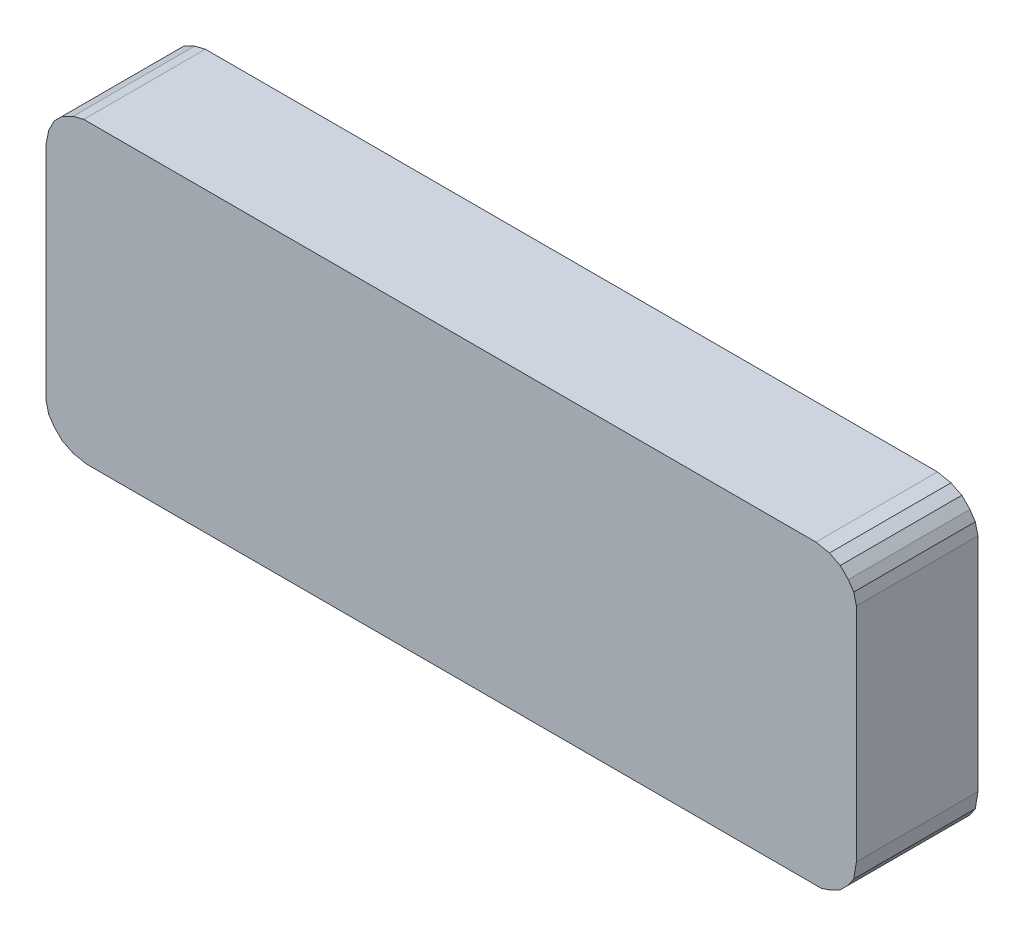
ISO-10303-21;
HEADER;
FILE_DESCRIPTION(('STEP AP214'),'2;1');
FILE_NAME('part.step','',(''),(''),'','','');
FILE_SCHEMA(('AUTOMOTIVE_DESIGN { 1 0 10303 214 1 1 1 1 }'));
ENDSEC;
DATA;
#1=APPLICATION_CONTEXT('core data for automotive mechanical design processes');
#2=APPLICATION_PROTOCOL_DEFINITION('international standard','automotive_design',2000,#1);
#3=PRODUCT_CONTEXT('',#1,'mechanical');
#4=PRODUCT('Part','Part','',(#3));
#5=PRODUCT_RELATED_PRODUCT_CATEGORY('part','',(#4));
#6=PRODUCT_DEFINITION_FORMATION('','',#4);
#7=PRODUCT_DEFINITION_CONTEXT('part definition',#1,'design');
#8=PRODUCT_DEFINITION('design','',#6,#7);
#9=PRODUCT_DEFINITION_SHAPE('','',#8);
#10=(LENGTH_UNIT() NAMED_UNIT(*) SI_UNIT(.MILLI.,.METRE.));
#11=(NAMED_UNIT(*) PLANE_ANGLE_UNIT() SI_UNIT($,.RADIAN.));
#12=(NAMED_UNIT(*) SI_UNIT($,.STERADIAN.) SOLID_ANGLE_UNIT());
#13=UNCERTAINTY_MEASURE_WITH_UNIT(LENGTH_MEASURE(1.E-05),#10,'distance_accuracy_value','');
#14=(GEOMETRIC_REPRESENTATION_CONTEXT(3) GLOBAL_UNCERTAINTY_ASSIGNED_CONTEXT((#13)) GLOBAL_UNIT_ASSIGNED_CONTEXT((#10,
#11,#12)) REPRESENTATION_CONTEXT('',''));
#15=CARTESIAN_POINT('',(0.,0.,0.));
#16=DIRECTION('',(0.,0.,1.));
#17=DIRECTION('',(1.,0.,0.));
#18=AXIS2_PLACEMENT_3D('',#15,#16,#17);
#19=CARTESIAN_POINT('',(-1.49999954,0.40000174,0.45));
#20=DIRECTION('',(0.,0.,1.));
#21=DIRECTION('',(1.,0.,0.));
#22=AXIS2_PLACEMENT_3D('',#19,#20,#21);
#23=PLANE('',#22);
#24=DIRECTION('',(-0.447213595499958,-0.894427190999916,0.));
#25=VECTOR('',#24,1.);
#26=CARTESIAN_POINT('',(-1.4699996,0.49000156,0.45));
#27=LINE('',#26,#25);
#28=CARTESIAN_POINT('',(-1.4699996,0.49000156,0.45));
#29=VERTEX_POINT('',#28);
#30=CARTESIAN_POINT('',(-1.48999956,0.450001640000001,0.45));
#31=VERTEX_POINT('',#30);
#32=EDGE_CURVE('E205',#29,#31,#27,.T.);
#33=ORIENTED_EDGE('',*,*,#32,.T.);
#34=DIRECTION('',(-0.196116135138182,-0.980580675690921,0.));
#35=VECTOR('',#34,1.);
#36=CARTESIAN_POINT('',(-1.48999956,0.45000164,0.45));
#37=LINE('',#36,#35);
#38=CARTESIAN_POINT('',(-1.49999954,0.40000174,0.45));
#39=VERTEX_POINT('',#38);
#40=EDGE_CURVE('E210',#31,#39,#37,.T.);
#41=ORIENTED_EDGE('',*,*,#40,.T.);
#42=DIRECTION('',(0.,1.,0.));
#43=VECTOR('',#42,1.);
#44=CARTESIAN_POINT('',(-1.49999954,-0.41999916,0.45));
#45=LINE('',#44,#43);
#46=CARTESIAN_POINT('',(-1.49999954,-0.419999159999998,0.45));
#47=VERTEX_POINT('',#46);
#48=EDGE_CURVE('E213',#47,#39,#45,.T.);
#49=ORIENTED_EDGE('',*,*,#48,.F.);
#50=DIRECTION('',(0.242535625036098,-0.970142500145391,0.));
#51=VECTOR('',#50,1.);
#52=CARTESIAN_POINT('',(-1.48999956,-0.45999908,0.45));
#53=LINE('',#52,#51);
#54=CARTESIAN_POINT('',(-1.48999956,-0.459999079999999,0.45));
#55=VERTEX_POINT('',#54);
#56=EDGE_CURVE('E217',#55,#47,#53,.F.);
#57=ORIENTED_EDGE('',*,*,#56,.F.);
#58=DIRECTION('',(0.554700196224998,-0.832050294337998,0.));
#59=VECTOR('',#58,1.);
#60=CARTESIAN_POINT('',(-1.4699996,-0.48999902,0.45));
#61=LINE('',#60,#59);
#62=CARTESIAN_POINT('',(-1.4699996,-0.48999902,0.45));
#63=VERTEX_POINT('',#62);
#64=EDGE_CURVE('E222',#63,#55,#61,.F.);
#65=ORIENTED_EDGE('',*,*,#64,.F.);
#66=DIRECTION('',(0.707106781186548,-0.707106781186548,0.));
#67=VECTOR('',#66,1.);
#68=CARTESIAN_POINT('',(-1.43999966,-0.51999896,0.45));
#69=LINE('',#68,#67);
#70=CARTESIAN_POINT('',(-1.43999966,-0.51999896,0.45));
#71=VERTEX_POINT('',#70);
#72=EDGE_CURVE('E228',#71,#63,#69,.F.);
#73=ORIENTED_EDGE('',*,*,#72,.F.);
#74=DIRECTION('',(0.894427190999916,-0.447213595499958,0.));
#75=VECTOR('',#74,1.);
#76=CARTESIAN_POINT('',(-1.39999974,-0.53999892,0.45));
#77=LINE('',#76,#75);
#78=CARTESIAN_POINT('',(-1.39999974,-0.539998920000003,0.45));
#79=VERTEX_POINT('',#78);
#80=EDGE_CURVE('E234',#79,#71,#77,.F.);
#81=ORIENTED_EDGE('',*,*,#80,.F.);
#82=DIRECTION('',(0.980580675690959,-0.196116135137992,0.));
#83=VECTOR('',#82,1.);
#84=CARTESIAN_POINT('',(-1.34999984,-0.5499989,0.45));
#85=LINE('',#84,#83);
#86=CARTESIAN_POINT('',(-1.34999984,-0.5499989,0.45));
#87=VERTEX_POINT('',#86);
#88=EDGE_CURVE('E239',#87,#79,#85,.F.);
#89=ORIENTED_EDGE('',*,*,#88,.F.);
#90=DIRECTION('',(1.,0.,0.));
#91=VECTOR('',#90,1.);
#92=CARTESIAN_POINT('',(1.3699998,-0.5499989,0.45));
#93=LINE('',#92,#91);
#94=CARTESIAN_POINT('',(1.3699998,-0.5499989,0.45));
#95=VERTEX_POINT('',#94);
#96=EDGE_CURVE('E245',#95,#87,#93,.F.);
#97=ORIENTED_EDGE('',*,*,#96,.F.);
#98=DIRECTION('',(0.948683298050414,0.316227766017138,0.));
#99=VECTOR('',#98,1.);
#100=CARTESIAN_POINT('',(1.39999974,-0.53999892,0.45));
#101=LINE('',#100,#99);
#102=CARTESIAN_POINT('',(1.39999974,-0.53999892,0.45));
#103=VERTEX_POINT('',#102);
#104=EDGE_CURVE('E251',#103,#95,#101,.F.);
#105=ORIENTED_EDGE('',*,*,#104,.F.);
#106=DIRECTION('',(0.894427190999916,0.447213595499958,0.));
#107=VECTOR('',#106,1.);
#108=CARTESIAN_POINT('',(1.43999966,-0.51999896,0.45));
#109=LINE('',#108,#107);
#110=CARTESIAN_POINT('',(1.43999965999999,-0.519998959999995,0.45));
#111=VERTEX_POINT('',#110);
#112=EDGE_CURVE('E257',#111,#103,#109,.F.);
#113=ORIENTED_EDGE('',*,*,#112,.F.);
#114=DIRECTION('',(0.707106781187048,0.707106781186048,0.));
#115=VECTOR('',#114,1.);
#116=CARTESIAN_POINT('',(1.4699996,-0.48999902,0.45));
#117=LINE('',#116,#115);
#118=CARTESIAN_POINT('',(1.4699996,-0.489999020000001,0.45));
#119=VERTEX_POINT('',#118);
#120=EDGE_CURVE('E263',#119,#111,#117,.F.);
#121=ORIENTED_EDGE('',*,*,#120,.F.);
#122=DIRECTION('',(0.554700196224998,0.832050294337998,0.));
#123=VECTOR('',#122,1.);
#124=CARTESIAN_POINT('',(1.48999956,-0.45999908,0.45));
#125=LINE('',#124,#123);
#126=CARTESIAN_POINT('',(1.48999956,-0.459999080000001,0.45));
#127=VERTEX_POINT('',#126);
#128=EDGE_CURVE('E269',#127,#119,#125,.F.);
#129=ORIENTED_EDGE('',*,*,#128,.F.);
#130=DIRECTION('',(0.164398987305033,0.986393923832198,0.));
#131=VECTOR('',#130,1.);
#132=CARTESIAN_POINT('',(1.49999954,-0.3999992,0.45));
#133=LINE('',#132,#131);
#134=CARTESIAN_POINT('',(1.49999954,-0.3999992,0.45));
#135=VERTEX_POINT('',#134);
#136=EDGE_CURVE('E275',#135,#127,#133,.F.);
#137=ORIENTED_EDGE('',*,*,#136,.F.);
#138=DIRECTION('',(0.,1.,0.));
#139=VECTOR('',#138,1.);
#140=CARTESIAN_POINT('',(1.49999954,0.4200017,0.45));
#141=LINE('',#140,#139);
#142=CARTESIAN_POINT('',(1.49999954,0.4200017,0.45));
#143=VERTEX_POINT('',#142);
#144=EDGE_CURVE('E281',#143,#135,#141,.F.);
#145=ORIENTED_EDGE('',*,*,#144,.F.);
#146=DIRECTION('',(-0.242535625036098,0.970142500145391,0.));
#147=VECTOR('',#146,1.);
#148=CARTESIAN_POINT('',(1.48999956,0.46000162,0.45));
#149=LINE('',#148,#147);
#150=CARTESIAN_POINT('',(1.48999956,0.460001619999999,0.45));
#151=VERTEX_POINT('',#150);
#152=EDGE_CURVE('E287',#151,#143,#149,.F.);
#153=ORIENTED_EDGE('',*,*,#152,.F.);
#154=DIRECTION('',(-0.554700196224998,0.832050294337998,0.));
#155=VECTOR('',#154,1.);
#156=CARTESIAN_POINT('',(1.4699996,0.49000156,0.45));
#157=LINE('',#156,#155);
#158=CARTESIAN_POINT('',(1.4699996,0.49000156,0.45));
#159=VERTEX_POINT('',#158);
#160=EDGE_CURVE('E293',#159,#151,#157,.F.);
#161=ORIENTED_EDGE('',*,*,#160,.F.);
#162=DIRECTION('',(-0.707106781186548,0.707106781186548,0.));
#163=VECTOR('',#162,1.);
#164=CARTESIAN_POINT('',(1.43999966,0.5200015,0.45));
#165=LINE('',#164,#163);
#166=CARTESIAN_POINT('',(1.43999966,0.5200015,0.45));
#167=VERTEX_POINT('',#166);
#168=EDGE_CURVE('E299',#167,#159,#165,.F.);
#169=ORIENTED_EDGE('',*,*,#168,.F.);
#170=DIRECTION('',(-0.894427190999916,0.447213595499958,0.));
#171=VECTOR('',#170,1.);
#172=CARTESIAN_POINT('',(1.39999974,0.54000146,0.45));
#173=LINE('',#172,#171);
#174=CARTESIAN_POINT('',(1.39999974,0.540001460000003,0.45));
#175=VERTEX_POINT('',#174);
#176=EDGE_CURVE('E305',#175,#167,#173,.F.);
#177=ORIENTED_EDGE('',*,*,#176,.F.);
#178=DIRECTION('',(-0.980580675690959,0.196116135137992,0.));
#179=VECTOR('',#178,1.);
#180=CARTESIAN_POINT('',(1.34999984,0.55000144,0.45));
#181=LINE('',#180,#179);
#182=CARTESIAN_POINT('',(1.34999984,0.55000144,0.45));
#183=VERTEX_POINT('',#182);
#184=EDGE_CURVE('E311',#183,#175,#181,.F.);
#185=ORIENTED_EDGE('',*,*,#184,.F.);
#186=DIRECTION('',(1.,0.,0.));
#187=VECTOR('',#186,1.);
#188=CARTESIAN_POINT('',(-1.35999982,0.55000144,0.45));
#189=LINE('',#188,#187);
#190=CARTESIAN_POINT('',(-1.35999982,0.550001439999997,0.45));
#191=VERTEX_POINT('',#190);
#192=EDGE_CURVE('E180',#191,#183,#189,.T.);
#193=ORIENTED_EDGE('',*,*,#192,.F.);
#194=DIRECTION('',(-0.970142500145332,-0.242535625036332,0.));
#195=VECTOR('',#194,1.);
#196=CARTESIAN_POINT('',(-1.35999982,0.55000144,0.45));
#197=LINE('',#196,#195);
#198=CARTESIAN_POINT('',(-1.39999974,0.54000146,0.45));
#199=VERTEX_POINT('',#198);
#200=EDGE_CURVE('E19',#191,#199,#197,.T.);
#201=ORIENTED_EDGE('',*,*,#200,.T.);
#202=DIRECTION('',(-0.894427190999917,-0.447213595499956,0.));
#203=VECTOR('',#202,1.);
#204=CARTESIAN_POINT('',(-1.39999974,0.54000146,0.45));
#205=LINE('',#204,#203);
#206=CARTESIAN_POINT('',(-1.43999966000001,0.5200015,0.45));
#207=VERTEX_POINT('',#206);
#208=EDGE_CURVE('E175',#199,#207,#205,.T.);
#209=ORIENTED_EDGE('',*,*,#208,.T.);
#210=DIRECTION('',(-0.707106781186546,-0.707106781186549,0.));
#211=VECTOR('',#210,1.);
#212=CARTESIAN_POINT('',(-1.43999966,0.5200015,0.45));
#213=LINE('',#212,#211);
#214=EDGE_CURVE('E199',#207,#29,#213,.T.);
#215=ORIENTED_EDGE('',*,*,#214,.T.);
#216=EDGE_LOOP('',(#33,#41,#49,#57,#65,#73,#81,#89,#97,#105,#113,#121,#129,#137,#145,#153,#161,
#169,#177,#185,#193,#201,#209,#215));
#217=FACE_BOUND('',#216,.T.);
#218=ADVANCED_FACE('F16',(#217),#23,.T.);
#219=CARTESIAN_POINT('',(-1.49999954,-0.41999916,0.));
#220=DIRECTION('',(-1.,0.,0.));
#221=DIRECTION('',(0.,0.,1.));
#222=AXIS2_PLACEMENT_3D('',#219,#220,#221);
#223=PLANE('',#222);
#224=DIRECTION('',(0.,0.,1.));
#225=VECTOR('',#224,1.);
#226=CARTESIAN_POINT('',(-1.49999954,0.40000174,0.));
#227=LINE('',#226,#225);
#228=CARTESIAN_POINT('',(-1.49999954,0.40000174,0.));
#229=VERTEX_POINT('',#228);
#230=EDGE_CURVE('E329',#229,#39,#227,.T.);
#231=ORIENTED_EDGE('',*,*,#230,.F.);
#232=DIRECTION('',(0.,1.,0.));
#233=VECTOR('',#232,1.);
#234=CARTESIAN_POINT('',(-1.49999954,0.40000174,0.));
#235=LINE('',#234,#233);
#236=CARTESIAN_POINT('',(-1.49999954,-0.419999159999999,0.));
#237=VERTEX_POINT('',#236);
#238=EDGE_CURVE('E335',#229,#237,#235,.F.);
#239=ORIENTED_EDGE('',*,*,#238,.T.);
#240=DIRECTION('',(0.,0.,1.));
#241=VECTOR('',#240,1.);
#242=CARTESIAN_POINT('',(-1.49999953999999,-0.419999159999998,0.));
#243=LINE('',#242,#241);
#244=EDGE_CURVE('E219',#47,#237,#243,.F.);
#245=ORIENTED_EDGE('',*,*,#244,.F.);
#246=ORIENTED_EDGE('',*,*,#48,.T.);
#247=EDGE_LOOP('',(#231,#239,#245,#246));
#248=FACE_BOUND('',#247,.T.);
#249=ADVANCED_FACE('F438',(#248),#223,.T.);
#250=CARTESIAN_POINT('',(-1.48999956,-0.45999908,0.));
#251=DIRECTION('',(-0.970142500145391,-0.242535625036098,0.));
#252=DIRECTION('',(0.242535625036098,-0.970142500145391,0.));
#253=AXIS2_PLACEMENT_3D('',#250,#251,#252);
#254=PLANE('',#253);
#255=ORIENTED_EDGE('',*,*,#244,.T.);
#256=DIRECTION('',(0.24253562503633,-0.970142500145333,0.));
#257=VECTOR('',#256,1.);
#258=CARTESIAN_POINT('',(-1.49999954,-0.41999916,0.));
#259=LINE('',#258,#257);
#260=CARTESIAN_POINT('',(-1.48999956,-0.459999079999999,0.));
#261=VERTEX_POINT('',#260);
#262=EDGE_CURVE('E339',#237,#261,#259,.T.);
#263=ORIENTED_EDGE('',*,*,#262,.T.);
#264=DIRECTION('',(0.,0.,1.));
#265=VECTOR('',#264,1.);
#266=CARTESIAN_POINT('',(-1.48999955999999,-0.459999079999994,0.));
#267=LINE('',#266,#265);
#268=EDGE_CURVE('E225',#55,#261,#267,.F.);
#269=ORIENTED_EDGE('',*,*,#268,.F.);
#270=ORIENTED_EDGE('',*,*,#56,.T.);
#271=EDGE_LOOP('',(#255,#263,#269,#270));
#272=FACE_BOUND('',#271,.T.);
#273=ADVANCED_FACE('F524',(#272),#254,.T.);
#274=CARTESIAN_POINT('',(-1.4699996,-0.48999902,0.));
#275=DIRECTION('',(-0.832050294337998,-0.554700196224998,0.));
#276=DIRECTION('',(0.554700196224998,-0.832050294337998,0.));
#277=AXIS2_PLACEMENT_3D('',#274,#275,#276);
#278=PLANE('',#277);
#279=ORIENTED_EDGE('',*,*,#268,.T.);
#280=DIRECTION('',(0.55470019622523,-0.832050294337843,0.));
#281=VECTOR('',#280,1.);
#282=CARTESIAN_POINT('',(-1.48999956,-0.45999908,0.));
#283=LINE('',#282,#281);
#284=CARTESIAN_POINT('',(-1.4699996,-0.48999902,0.));
#285=VERTEX_POINT('',#284);
#286=EDGE_CURVE('E343',#261,#285,#283,.T.);
#287=ORIENTED_EDGE('',*,*,#286,.T.);
#288=DIRECTION('',(0.,0.,1.));
#289=VECTOR('',#288,1.);
#290=CARTESIAN_POINT('',(-1.4699996,-0.48999902,0.));
#291=LINE('',#290,#289);
#292=EDGE_CURVE('E231',#63,#285,#291,.F.);
#293=ORIENTED_EDGE('',*,*,#292,.F.);
#294=ORIENTED_EDGE('',*,*,#64,.T.);
#295=EDGE_LOOP('',(#279,#287,#293,#294));
#296=FACE_BOUND('',#295,.T.);
#297=ADVANCED_FACE('F520',(#296),#278,.T.);
#298=CARTESIAN_POINT('',(-1.43999966,-0.51999896,0.));
#299=DIRECTION('',(-0.707106781186548,-0.707106781186548,0.));
#300=DIRECTION('',(0.707106781186548,-0.707106781186548,0.));
#301=AXIS2_PLACEMENT_3D('',#298,#299,#300);
#302=PLANE('',#301);
#303=ORIENTED_EDGE('',*,*,#292,.T.);
#304=DIRECTION('',(0.707106781186545,-0.70710678118655,0.));
#305=VECTOR('',#304,1.);
#306=CARTESIAN_POINT('',(-1.4699996,-0.48999902,0.));
#307=LINE('',#306,#305);
#308=CARTESIAN_POINT('',(-1.43999966,-0.51999896,0.));
#309=VERTEX_POINT('',#308);
#310=EDGE_CURVE('E347',#285,#309,#307,.T.);
#311=ORIENTED_EDGE('',*,*,#310,.T.);
#312=DIRECTION('',(0.,0.,1.));
#313=VECTOR('',#312,1.);
#314=CARTESIAN_POINT('',(-1.43999966,-0.51999896,0.));
#315=LINE('',#314,#313);
#316=EDGE_CURVE('E237',#71,#309,#315,.F.);
#317=ORIENTED_EDGE('',*,*,#316,.F.);
#318=ORIENTED_EDGE('',*,*,#72,.T.);
#319=EDGE_LOOP('',(#303,#311,#317,#318));
#320=FACE_BOUND('',#319,.T.);
#321=ADVANCED_FACE('F516',(#320),#302,.T.);
#322=CARTESIAN_POINT('',(-1.39999974,-0.53999892,0.));
#323=DIRECTION('',(-0.447213595499958,-0.894427190999916,0.));
#324=DIRECTION('',(0.894427190999916,-0.447213595499958,0.));
#325=AXIS2_PLACEMENT_3D('',#322,#323,#324);
#326=PLANE('',#325);
#327=ORIENTED_EDGE('',*,*,#316,.T.);
#328=DIRECTION('',(0.894427190999917,-0.447213595499956,0.));
#329=VECTOR('',#328,1.);
#330=CARTESIAN_POINT('',(-1.43999966,-0.51999896,0.));
#331=LINE('',#330,#329);
#332=CARTESIAN_POINT('',(-1.39999974,-0.539998920000003,0.));
#333=VERTEX_POINT('',#332);
#334=EDGE_CURVE('E351',#309,#333,#331,.T.);
#335=ORIENTED_EDGE('',*,*,#334,.T.);
#336=DIRECTION('',(0.,0.,1.));
#337=VECTOR('',#336,1.);
#338=CARTESIAN_POINT('',(-1.39999974,-0.53999892000001,0.));
#339=LINE('',#338,#337);
#340=EDGE_CURVE('E242',#79,#333,#339,.F.);
#341=ORIENTED_EDGE('',*,*,#340,.F.);
#342=ORIENTED_EDGE('',*,*,#80,.T.);
#343=EDGE_LOOP('',(#327,#335,#341,#342));
#344=FACE_BOUND('',#343,.T.);
#345=ADVANCED_FACE('F512',(#344),#326,.T.);
#346=CARTESIAN_POINT('',(-1.34999984,-0.5499989,0.));
#347=DIRECTION('',(-0.196116135137992,-0.980580675690959,0.));
#348=DIRECTION('',(0.980580675690959,-0.196116135137992,0.));
#349=AXIS2_PLACEMENT_3D('',#346,#347,#348);
#350=PLANE('',#349);
#351=ORIENTED_EDGE('',*,*,#340,.T.);
#352=DIRECTION('',(0.980580675690921,-0.196116135138183,0.));
#353=VECTOR('',#352,1.);
#354=CARTESIAN_POINT('',(-1.39999974,-0.53999892,0.));
#355=LINE('',#354,#353);
#356=CARTESIAN_POINT('',(-1.34999984,-0.5499989,0.));
#357=VERTEX_POINT('',#356);
#358=EDGE_CURVE('E355',#333,#357,#355,.T.);
#359=ORIENTED_EDGE('',*,*,#358,.T.);
#360=DIRECTION('',(0.,0.,-1.));
#361=VECTOR('',#360,1.);
#362=CARTESIAN_POINT('',(-1.34999984,-0.5499989,0.));
#363=LINE('',#362,#361);
#364=EDGE_CURVE('E248',#87,#357,#363,.T.);
#365=ORIENTED_EDGE('',*,*,#364,.F.);
#366=ORIENTED_EDGE('',*,*,#88,.T.);
#367=EDGE_LOOP('',(#351,#359,#365,#366));
#368=FACE_BOUND('',#367,.T.);
#369=ADVANCED_FACE('F508',(#368),#350,.T.);
#370=CARTESIAN_POINT('',(1.3699998,-0.5499989,0.));
#371=DIRECTION('',(0.,-1.,0.));
#372=DIRECTION('',(0.,0.,-1.));
#373=AXIS2_PLACEMENT_3D('',#370,#371,#372);
#374=PLANE('',#373);
#375=ORIENTED_EDGE('',*,*,#364,.T.);
#376=DIRECTION('',(1.,0.,0.));
#377=VECTOR('',#376,1.);
#378=CARTESIAN_POINT('',(-1.49999954,-0.5499989,0.));
#379=LINE('',#378,#377);
#380=CARTESIAN_POINT('',(1.3699998,-0.5499989,0.));
#381=VERTEX_POINT('',#380);
#382=EDGE_CURVE('E359',#357,#381,#379,.T.);
#383=ORIENTED_EDGE('',*,*,#382,.T.);
#384=DIRECTION('',(0.,0.,1.));
#385=VECTOR('',#384,1.);
#386=CARTESIAN_POINT('',(1.3699998,-0.54999890000001,0.));
#387=LINE('',#386,#385);
#388=EDGE_CURVE('E254',#95,#381,#387,.F.);
#389=ORIENTED_EDGE('',*,*,#388,.F.);
#390=ORIENTED_EDGE('',*,*,#96,.T.);
#391=EDGE_LOOP('',(#375,#383,#389,#390));
#392=FACE_BOUND('',#391,.T.);
#393=ADVANCED_FACE('F504',(#392),#374,.T.);
#394=CARTESIAN_POINT('',(1.39999974,-0.53999892,0.));
#395=DIRECTION('',(0.316227766017138,-0.948683298050414,0.));
#396=DIRECTION('',(0.948683298050414,0.316227766017138,0.));
#397=AXIS2_PLACEMENT_3D('',#394,#395,#396);
#398=PLANE('',#397);
#399=ORIENTED_EDGE('',*,*,#388,.T.);
#400=DIRECTION('',(0.948683298050515,0.316227766016836,0.));
#401=VECTOR('',#400,1.);
#402=CARTESIAN_POINT('',(1.3699998,-0.5499989,0.));
#403=LINE('',#402,#401);
#404=CARTESIAN_POINT('',(1.39999974,-0.53999892,0.));
#405=VERTEX_POINT('',#404);
#406=EDGE_CURVE('E363',#381,#405,#403,.T.);
#407=ORIENTED_EDGE('',*,*,#406,.T.);
#408=DIRECTION('',(0.,0.,1.));
#409=VECTOR('',#408,1.);
#410=CARTESIAN_POINT('',(1.39999974,-0.53999892,0.));
#411=LINE('',#410,#409);
#412=EDGE_CURVE('E260',#103,#405,#411,.F.);
#413=ORIENTED_EDGE('',*,*,#412,.F.);
#414=ORIENTED_EDGE('',*,*,#104,.T.);
#415=EDGE_LOOP('',(#399,#407,#413,#414));
#416=FACE_BOUND('',#415,.T.);
#417=ADVANCED_FACE('F500',(#416),#398,.T.);
#418=CARTESIAN_POINT('',(1.43999966,-0.51999896,0.));
#419=DIRECTION('',(0.447213595499958,-0.894427190999916,0.));
#420=DIRECTION('',(0.894427190999916,0.447213595499958,0.));
#421=AXIS2_PLACEMENT_3D('',#418,#419,#420);
#422=PLANE('',#421);
#423=ORIENTED_EDGE('',*,*,#412,.T.);
#424=DIRECTION('',(0.894427190999916,0.447213595499958,0.));
#425=VECTOR('',#424,1.);
#426=CARTESIAN_POINT('',(1.39999974,-0.53999892,0.));
#427=LINE('',#426,#425);
#428=CARTESIAN_POINT('',(1.43999965999999,-0.519998959999995,0.));
#429=VERTEX_POINT('',#428);
#430=EDGE_CURVE('E367',#405,#429,#427,.T.);
#431=ORIENTED_EDGE('',*,*,#430,.T.);
#432=DIRECTION('',(0.,0.,1.));
#433=VECTOR('',#432,1.);
#434=CARTESIAN_POINT('',(1.43999965999998,-0.519998959999979,0.));
#435=LINE('',#434,#433);
#436=EDGE_CURVE('E266',#111,#429,#435,.F.);
#437=ORIENTED_EDGE('',*,*,#436,.F.);
#438=ORIENTED_EDGE('',*,*,#112,.T.);
#439=EDGE_LOOP('',(#423,#431,#437,#438));
#440=FACE_BOUND('',#439,.T.);
#441=ADVANCED_FACE('F496',(#440),#422,.T.);
#442=CARTESIAN_POINT('',(1.4699996,-0.48999902,0.));
#443=DIRECTION('',(0.707106781186048,-0.707106781187048,0.));
#444=DIRECTION('',(0.707106781187048,0.707106781186048,0.));
#445=AXIS2_PLACEMENT_3D('',#442,#443,#444);
#446=PLANE('',#445);
#447=ORIENTED_EDGE('',*,*,#436,.T.);
#448=DIRECTION('',(0.707106781186545,0.70710678118655,0.));
#449=VECTOR('',#448,1.);
#450=CARTESIAN_POINT('',(1.43999966,-0.51999896,0.));
#451=LINE('',#450,#449);
#452=CARTESIAN_POINT('',(1.4699996,-0.489999020000001,0.));
#453=VERTEX_POINT('',#452);
#454=EDGE_CURVE('E371',#429,#453,#451,.T.);
#455=ORIENTED_EDGE('',*,*,#454,.T.);
#456=DIRECTION('',(0.,0.,1.));
#457=VECTOR('',#456,1.);
#458=CARTESIAN_POINT('',(1.46999960000001,-0.489999020000006,0.));
#459=LINE('',#458,#457);
#460=EDGE_CURVE('E272',#119,#453,#459,.F.);
#461=ORIENTED_EDGE('',*,*,#460,.F.);
#462=ORIENTED_EDGE('',*,*,#120,.T.);
#463=EDGE_LOOP('',(#447,#455,#461,#462));
#464=FACE_BOUND('',#463,.T.);
#465=ADVANCED_FACE('F492',(#464),#446,.T.);
#466=CARTESIAN_POINT('',(1.48999956,-0.45999908,0.));
#467=DIRECTION('',(0.832050294337998,-0.554700196224998,0.));
#468=DIRECTION('',(0.554700196224998,0.832050294337998,0.));
#469=AXIS2_PLACEMENT_3D('',#466,#467,#468);
#470=PLANE('',#469);
#471=ORIENTED_EDGE('',*,*,#460,.T.);
#472=DIRECTION('',(0.554700196225226,0.832050294337846,0.));
#473=VECTOR('',#472,1.);
#474=CARTESIAN_POINT('',(1.4699996,-0.48999902,0.));
#475=LINE('',#474,#473);
#476=CARTESIAN_POINT('',(1.48999956,-0.459999080000001,0.));
#477=VERTEX_POINT('',#476);
#478=EDGE_CURVE('E375',#453,#477,#475,.T.);
#479=ORIENTED_EDGE('',*,*,#478,.T.);
#480=DIRECTION('',(0.,0.,1.));
#481=VECTOR('',#480,1.);
#482=CARTESIAN_POINT('',(1.48999956000002,-0.459999080000003,0.));
#483=LINE('',#482,#481);
#484=EDGE_CURVE('E278',#127,#477,#483,.F.);
#485=ORIENTED_EDGE('',*,*,#484,.F.);
#486=ORIENTED_EDGE('',*,*,#128,.T.);
#487=EDGE_LOOP('',(#471,#479,#485,#486));
#488=FACE_BOUND('',#487,.T.);
#489=ADVANCED_FACE('F488',(#488),#470,.T.);
#490=CARTESIAN_POINT('',(1.49999954,-0.3999992,0.));
#491=DIRECTION('',(0.986393923832198,-0.164398987305033,0.));
#492=DIRECTION('',(0.164398987305033,0.986393923832198,0.));
#493=AXIS2_PLACEMENT_3D('',#490,#491,#492);
#494=PLANE('',#493);
#495=ORIENTED_EDGE('',*,*,#484,.T.);
#496=DIRECTION('',(0.164398987305359,0.986393923832143,0.));
#497=VECTOR('',#496,1.);
#498=CARTESIAN_POINT('',(1.48999956,-0.45999908,0.));
#499=LINE('',#498,#497);
#500=CARTESIAN_POINT('',(1.49999954,-0.3999992,0.));
#501=VERTEX_POINT('',#500);
#502=EDGE_CURVE('E379',#477,#501,#499,.T.);
#503=ORIENTED_EDGE('',*,*,#502,.T.);
#504=DIRECTION('',(0.,0.,-1.));
#505=VECTOR('',#504,1.);
#506=CARTESIAN_POINT('',(1.49999954,-0.3999992,0.));
#507=LINE('',#506,#505);
#508=EDGE_CURVE('E284',#135,#501,#507,.T.);
#509=ORIENTED_EDGE('',*,*,#508,.F.);
#510=ORIENTED_EDGE('',*,*,#136,.T.);
#511=EDGE_LOOP('',(#495,#503,#509,#510));
#512=FACE_BOUND('',#511,.T.);
#513=ADVANCED_FACE('F484',(#512),#494,.T.);
#514=CARTESIAN_POINT('',(1.49999954,0.4200017,0.));
#515=DIRECTION('',(1.,0.,0.));
#516=DIRECTION('',(0.,0.,-1.));
#517=AXIS2_PLACEMENT_3D('',#514,#515,#516);
#518=PLANE('',#517);
#519=ORIENTED_EDGE('',*,*,#508,.T.);
#520=DIRECTION('',(0.,1.,0.));
#521=VECTOR('',#520,1.);
#522=CARTESIAN_POINT('',(1.49999954,0.40000174,0.));
#523=LINE('',#522,#521);
#524=CARTESIAN_POINT('',(1.49999954,0.4200017,0.));
#525=VERTEX_POINT('',#524);
#526=EDGE_CURVE('E383',#501,#525,#523,.T.);
#527=ORIENTED_EDGE('',*,*,#526,.T.);
#528=DIRECTION('',(0.,0.,1.));
#529=VECTOR('',#528,1.);
#530=CARTESIAN_POINT('',(1.49999953999999,0.4200017,0.));
#531=LINE('',#530,#529);
#532=EDGE_CURVE('E290',#143,#525,#531,.F.);
#533=ORIENTED_EDGE('',*,*,#532,.F.);
#534=ORIENTED_EDGE('',*,*,#144,.T.);
#535=EDGE_LOOP('',(#519,#527,#533,#534));
#536=FACE_BOUND('',#535,.T.);
#537=ADVANCED_FACE('F480',(#536),#518,.T.);
#538=CARTESIAN_POINT('',(1.48999956,0.46000162,0.));
#539=DIRECTION('',(0.970142500145391,0.242535625036098,0.));
#540=DIRECTION('',(-0.242535625036098,0.970142500145391,0.));
#541=AXIS2_PLACEMENT_3D('',#538,#539,#540);
#542=PLANE('',#541);
#543=ORIENTED_EDGE('',*,*,#532,.T.);
#544=DIRECTION('',(-0.242535625036335,0.970142500145331,0.));
#545=VECTOR('',#544,1.);
#546=CARTESIAN_POINT('',(1.49999954,0.4200017,0.));
#547=LINE('',#546,#545);
#548=CARTESIAN_POINT('',(1.48999956,0.460001619999999,0.));
#549=VERTEX_POINT('',#548);
#550=EDGE_CURVE('E387',#525,#549,#547,.T.);
#551=ORIENTED_EDGE('',*,*,#550,.T.);
#552=DIRECTION('',(0.,0.,1.));
#553=VECTOR('',#552,1.);
#554=CARTESIAN_POINT('',(1.48999955999999,0.460001619999995,0.));
#555=LINE('',#554,#553);
#556=EDGE_CURVE('E296',#151,#549,#555,.F.);
#557=ORIENTED_EDGE('',*,*,#556,.F.);
#558=ORIENTED_EDGE('',*,*,#152,.T.);
#559=EDGE_LOOP('',(#543,#551,#557,#558));
#560=FACE_BOUND('',#559,.T.);
#561=ADVANCED_FACE('F476',(#560),#542,.T.);
#562=CARTESIAN_POINT('',(1.4699996,0.49000156,0.));
#563=DIRECTION('',(0.832050294337998,0.554700196224998,0.));
#564=DIRECTION('',(-0.554700196224998,0.832050294337998,0.));
#565=AXIS2_PLACEMENT_3D('',#562,#563,#564);
#566=PLANE('',#565);
#567=ORIENTED_EDGE('',*,*,#556,.T.);
#568=DIRECTION('',(-0.554700196225224,0.832050294337847,0.));
#569=VECTOR('',#568,1.);
#570=CARTESIAN_POINT('',(1.48999956,0.46000162,0.));
#571=LINE('',#570,#569);
#572=CARTESIAN_POINT('',(1.4699996,0.49000156,0.));
#573=VERTEX_POINT('',#572);
#574=EDGE_CURVE('E391',#549,#573,#571,.T.);
#575=ORIENTED_EDGE('',*,*,#574,.T.);
#576=DIRECTION('',(0.,0.,1.));
#577=VECTOR('',#576,1.);
#578=CARTESIAN_POINT('',(1.4699996,0.49000156,0.));
#579=LINE('',#578,#577);
#580=EDGE_CURVE('E302',#159,#573,#579,.F.);
#581=ORIENTED_EDGE('',*,*,#580,.F.);
#582=ORIENTED_EDGE('',*,*,#160,.T.);
#583=EDGE_LOOP('',(#567,#575,#581,#582));
#584=FACE_BOUND('',#583,.T.);
#585=ADVANCED_FACE('F472',(#584),#566,.T.);
#586=CARTESIAN_POINT('',(1.43999966,0.5200015,0.));
#587=DIRECTION('',(0.707106781186548,0.707106781186548,0.));
#588=DIRECTION('',(-0.707106781186548,0.707106781186548,0.));
#589=AXIS2_PLACEMENT_3D('',#586,#587,#588);
#590=PLANE('',#589);
#591=ORIENTED_EDGE('',*,*,#580,.T.);
#592=DIRECTION('',(-0.707106781186546,0.707106781186549,0.));
#593=VECTOR('',#592,1.);
#594=CARTESIAN_POINT('',(1.4699996,0.49000156,0.));
#595=LINE('',#594,#593);
#596=CARTESIAN_POINT('',(1.43999966,0.5200015,0.));
#597=VERTEX_POINT('',#596);
#598=EDGE_CURVE('E395',#573,#597,#595,.T.);
#599=ORIENTED_EDGE('',*,*,#598,.T.);
#600=DIRECTION('',(0.,0.,1.));
#601=VECTOR('',#600,1.);
#602=CARTESIAN_POINT('',(1.43999966,0.5200015,0.));
#603=LINE('',#602,#601);
#604=EDGE_CURVE('E308',#167,#597,#603,.F.);
#605=ORIENTED_EDGE('',*,*,#604,.F.);
#606=ORIENTED_EDGE('',*,*,#168,.T.);
#607=EDGE_LOOP('',(#591,#599,#605,#606));
#608=FACE_BOUND('',#607,.T.);
#609=ADVANCED_FACE('F468',(#608),#590,.T.);
#610=CARTESIAN_POINT('',(1.39999974,0.54000146,0.));
#611=DIRECTION('',(0.447213595499958,0.894427190999916,0.));
#612=DIRECTION('',(-0.894427190999916,0.447213595499958,0.));
#613=AXIS2_PLACEMENT_3D('',#610,#611,#612);
#614=PLANE('',#613);
#615=ORIENTED_EDGE('',*,*,#604,.T.);
#616=DIRECTION('',(-0.894427190999916,0.447213595499958,0.));
#617=VECTOR('',#616,1.);
#618=CARTESIAN_POINT('',(1.43999966,0.5200015,0.));
#619=LINE('',#618,#617);
#620=CARTESIAN_POINT('',(1.39999974,0.540001460000003,0.));
#621=VERTEX_POINT('',#620);
#622=EDGE_CURVE('E399',#597,#621,#619,.T.);
#623=ORIENTED_EDGE('',*,*,#622,.T.);
#624=DIRECTION('',(0.,0.,1.));
#625=VECTOR('',#624,1.);
#626=CARTESIAN_POINT('',(1.39999974,0.54000146000001,0.));
#627=LINE('',#626,#625);
#628=EDGE_CURVE('E314',#175,#621,#627,.F.);
#629=ORIENTED_EDGE('',*,*,#628,.F.);
#630=ORIENTED_EDGE('',*,*,#176,.T.);
#631=EDGE_LOOP('',(#615,#623,#629,#630));
#632=FACE_BOUND('',#631,.T.);
#633=ADVANCED_FACE('F464',(#632),#614,.T.);
#634=CARTESIAN_POINT('',(1.34999984,0.55000144,0.));
#635=DIRECTION('',(0.196116135137992,0.980580675690959,0.));
#636=DIRECTION('',(-0.980580675690959,0.196116135137992,0.));
#637=AXIS2_PLACEMENT_3D('',#634,#635,#636);
#638=PLANE('',#637);
#639=ORIENTED_EDGE('',*,*,#628,.T.);
#640=DIRECTION('',(-0.980580675690921,0.196116135138182,0.));
#641=VECTOR('',#640,1.);
#642=CARTESIAN_POINT('',(1.39999974,0.54000146,0.));
#643=LINE('',#642,#641);
#644=CARTESIAN_POINT('',(1.34999984,0.55000144,0.));
#645=VERTEX_POINT('',#644);
#646=EDGE_CURVE('E403',#621,#645,#643,.T.);
#647=ORIENTED_EDGE('',*,*,#646,.T.);
#648=DIRECTION('',(0.,0.,1.));
#649=VECTOR('',#648,1.);
#650=CARTESIAN_POINT('',(1.34999984,0.55000144,0.));
#651=LINE('',#650,#649);
#652=EDGE_CURVE('E319',#183,#645,#651,.F.);
#653=ORIENTED_EDGE('',*,*,#652,.F.);
#654=ORIENTED_EDGE('',*,*,#184,.T.);
#655=EDGE_LOOP('',(#639,#647,#653,#654));
#656=FACE_BOUND('',#655,.T.);
#657=ADVANCED_FACE('F460',(#656),#638,.T.);
#658=CARTESIAN_POINT('',(-1.35999982,0.55000144,0.));
#659=DIRECTION('',(0.,1.,0.));
#660=DIRECTION('',(0.,0.,1.));
#661=AXIS2_PLACEMENT_3D('',#658,#659,#660);
#662=PLANE('',#661);
#663=ORIENTED_EDGE('',*,*,#652,.T.);
#664=DIRECTION('',(1.,0.,0.));
#665=VECTOR('',#664,1.);
#666=CARTESIAN_POINT('',(-1.49999954,0.55000144,0.));
#667=LINE('',#666,#665);
#668=CARTESIAN_POINT('',(-1.35999982,0.550001439999997,0.));
#669=VERTEX_POINT('',#668);
#670=EDGE_CURVE('E407',#645,#669,#667,.F.);
#671=ORIENTED_EDGE('',*,*,#670,.T.);
#672=DIRECTION('',(0.,0.,1.));
#673=VECTOR('',#672,1.);
#674=CARTESIAN_POINT('',(-1.35999982,0.55000143999999,0.));
#675=LINE('',#674,#673);
#676=EDGE_CURVE('E194',#191,#669,#675,.F.);
#677=ORIENTED_EDGE('',*,*,#676,.F.);
#678=ORIENTED_EDGE('',*,*,#192,.T.);
#679=EDGE_LOOP('',(#663,#671,#677,#678));
#680=FACE_BOUND('',#679,.T.);
#681=ADVANCED_FACE('F457',(#680),#662,.T.);
#682=CARTESIAN_POINT('',(-1.39999974,0.54000146,0.));
#683=DIRECTION('',(-0.242535625036098,0.970142500145391,0.));
#684=DIRECTION('',(-0.970142500145391,-0.242535625036098,0.));
#685=AXIS2_PLACEMENT_3D('',#682,#683,#684);
#686=PLANE('',#685);
#687=ORIENTED_EDGE('',*,*,#676,.T.);
#688=DIRECTION('',(-0.970142500145332,-0.242535625036332,0.));
#689=VECTOR('',#688,1.);
#690=CARTESIAN_POINT('',(-1.35999982,0.55000144,0.));
#691=LINE('',#690,#689);
#692=CARTESIAN_POINT('',(-1.39999974,0.54000146,0.));
#693=VERTEX_POINT('',#692);
#694=EDGE_CURVE('E188',#669,#693,#691,.T.);
#695=ORIENTED_EDGE('',*,*,#694,.T.);
#696=DIRECTION('',(0.,0.,1.));
#697=VECTOR('',#696,1.);
#698=CARTESIAN_POINT('',(-1.39999974,0.54000146,0.));
#699=LINE('',#698,#697);
#700=EDGE_CURVE('E185',#199,#693,#699,.F.);
#701=ORIENTED_EDGE('',*,*,#700,.F.);
#702=ORIENTED_EDGE('',*,*,#200,.F.);
#703=EDGE_LOOP('',(#687,#695,#701,#702));
#704=FACE_BOUND('',#703,.T.);
#705=ADVANCED_FACE('F186',(#704),#686,.T.);
#706=CARTESIAN_POINT('',(-1.43999966,0.5200015,0.));
#707=DIRECTION('',(-0.447213595499958,0.894427190999916,0.));
#708=DIRECTION('',(-0.894427190999916,-0.447213595499958,0.));
#709=AXIS2_PLACEMENT_3D('',#706,#707,#708);
#710=PLANE('',#709);
#711=ORIENTED_EDGE('',*,*,#700,.T.);
#712=DIRECTION('',(-0.894427190999917,-0.447213595499956,0.));
#713=VECTOR('',#712,1.);
#714=CARTESIAN_POINT('',(-1.39999974,0.54000146,0.));
#715=LINE('',#714,#713);
#716=CARTESIAN_POINT('',(-1.43999966000001,0.5200015,0.));
#717=VERTEX_POINT('',#716);
#718=EDGE_CURVE('E413',#693,#717,#715,.T.);
#719=ORIENTED_EDGE('',*,*,#718,.T.);
#720=DIRECTION('',(0.,0.,1.));
#721=VECTOR('',#720,1.);
#722=CARTESIAN_POINT('',(-1.43999966000002,0.520001500000021,0.));
#723=LINE('',#722,#721);
#724=EDGE_CURVE('E193',#207,#717,#723,.F.);
#725=ORIENTED_EDGE('',*,*,#724,.F.);
#726=ORIENTED_EDGE('',*,*,#208,.F.);
#727=EDGE_LOOP('',(#711,#719,#725,#726));
#728=FACE_BOUND('',#727,.T.);
#729=ADVANCED_FACE('F196',(#728),#710,.T.);
#730=CARTESIAN_POINT('',(-1.4699996,0.49000156,0.));
#731=DIRECTION('',(-0.707106781187048,0.707106781186048,0.));
#732=DIRECTION('',(-0.707106781186048,-0.707106781187048,0.));
#733=AXIS2_PLACEMENT_3D('',#730,#731,#732);
#734=PLANE('',#733);
#735=ORIENTED_EDGE('',*,*,#724,.T.);
#736=DIRECTION('',(-0.707106781186546,-0.707106781186549,0.));
#737=VECTOR('',#736,1.);
#738=CARTESIAN_POINT('',(-1.43999966,0.5200015,0.));
#739=LINE('',#738,#737);
#740=CARTESIAN_POINT('',(-1.4699996,0.49000156,0.));
#741=VERTEX_POINT('',#740);
#742=EDGE_CURVE('E416',#717,#741,#739,.T.);
#743=ORIENTED_EDGE('',*,*,#742,.T.);
#744=DIRECTION('',(0.,0.,1.));
#745=VECTOR('',#744,1.);
#746=CARTESIAN_POINT('',(-1.4699996,0.49000156,0.));
#747=LINE('',#746,#745);
#748=EDGE_CURVE('E326',#29,#741,#747,.F.);
#749=ORIENTED_EDGE('',*,*,#748,.F.);
#750=ORIENTED_EDGE('',*,*,#214,.F.);
#751=EDGE_LOOP('',(#735,#743,#749,#750));
#752=FACE_BOUND('',#751,.T.);
#753=ADVANCED_FACE('F432',(#752),#734,.T.);
#754=CARTESIAN_POINT('',(-1.48999956,0.45000164,0.));
#755=DIRECTION('',(-0.894427190999916,0.447213595499958,0.));
#756=DIRECTION('',(-0.447213595499958,-0.894427190999916,0.));
#757=AXIS2_PLACEMENT_3D('',#754,#755,#756);
#758=PLANE('',#757);
#759=ORIENTED_EDGE('',*,*,#748,.T.);
#760=DIRECTION('',(-0.447213595499958,-0.894427190999916,0.));
#761=VECTOR('',#760,1.);
#762=CARTESIAN_POINT('',(-1.4699996,0.49000156,0.));
#763=LINE('',#762,#761);
#764=CARTESIAN_POINT('',(-1.48999956,0.450001640000001,0.));
#765=VERTEX_POINT('',#764);
#766=EDGE_CURVE('E26',#741,#765,#763,.T.);
#767=ORIENTED_EDGE('',*,*,#766,.T.);
#768=DIRECTION('',(0.,0.,1.));
#769=VECTOR('',#768,1.);
#770=CARTESIAN_POINT('',(-1.48999956000001,0.450001640000002,0.));
#771=LINE('',#770,#769);
#772=EDGE_CURVE('E34',#31,#765,#771,.F.);
#773=ORIENTED_EDGE('',*,*,#772,.F.);
#774=ORIENTED_EDGE('',*,*,#32,.F.);
#775=EDGE_LOOP('',(#759,#767,#773,#774));
#776=FACE_BOUND('',#775,.T.);
#777=ADVANCED_FACE('F425',(#776),#758,.T.);
#778=CARTESIAN_POINT('',(-1.49999954,0.40000174,0.));
#779=DIRECTION('',(-0.980580675690959,0.196116135137992,0.));
#780=DIRECTION('',(-0.196116135137992,-0.980580675690959,0.));
#781=AXIS2_PLACEMENT_3D('',#778,#779,#780);
#782=PLANE('',#781);
#783=ORIENTED_EDGE('',*,*,#772,.T.);
#784=DIRECTION('',(-0.196116135138182,-0.980580675690921,0.));
#785=VECTOR('',#784,1.);
#786=CARTESIAN_POINT('',(-1.48999956,0.45000164,0.));
#787=LINE('',#786,#785);
#788=EDGE_CURVE('E11',#765,#229,#787,.T.);
#789=ORIENTED_EDGE('',*,*,#788,.T.);
#790=ORIENTED_EDGE('',*,*,#230,.T.);
#791=ORIENTED_EDGE('',*,*,#40,.F.);
#792=EDGE_LOOP('',(#783,#789,#790,#791));
#793=FACE_BOUND('',#792,.T.);
#794=ADVANCED_FACE('F439',(#793),#782,.T.);
#795=CARTESIAN_POINT('',(-1.49999954,0.40000174,0.));
#796=DIRECTION('',(0.,0.,1.));
#797=DIRECTION('',(1.,0.,0.));
#798=AXIS2_PLACEMENT_3D('',#795,#796,#797);
#799=PLANE('',#798);
#800=ORIENTED_EDGE('',*,*,#766,.F.);
#801=ORIENTED_EDGE('',*,*,#742,.F.);
#802=ORIENTED_EDGE('',*,*,#718,.F.);
#803=ORIENTED_EDGE('',*,*,#694,.F.);
#804=ORIENTED_EDGE('',*,*,#670,.F.);
#805=ORIENTED_EDGE('',*,*,#646,.F.);
#806=ORIENTED_EDGE('',*,*,#622,.F.);
#807=ORIENTED_EDGE('',*,*,#598,.F.);
#808=ORIENTED_EDGE('',*,*,#574,.F.);
#809=ORIENTED_EDGE('',*,*,#550,.F.);
#810=ORIENTED_EDGE('',*,*,#526,.F.);
#811=ORIENTED_EDGE('',*,*,#502,.F.);
#812=ORIENTED_EDGE('',*,*,#478,.F.);
#813=ORIENTED_EDGE('',*,*,#454,.F.);
#814=ORIENTED_EDGE('',*,*,#430,.F.);
#815=ORIENTED_EDGE('',*,*,#406,.F.);
#816=ORIENTED_EDGE('',*,*,#382,.F.);
#817=ORIENTED_EDGE('',*,*,#358,.F.);
#818=ORIENTED_EDGE('',*,*,#334,.F.);
#819=ORIENTED_EDGE('',*,*,#310,.F.);
#820=ORIENTED_EDGE('',*,*,#286,.F.);
#821=ORIENTED_EDGE('',*,*,#262,.F.);
#822=ORIENTED_EDGE('',*,*,#238,.F.);
#823=ORIENTED_EDGE('',*,*,#788,.F.);
#824=EDGE_LOOP('',(#800,#801,#802,#803,#804,#805,#806,#807,#808,#809,#810,#811,#812,#813,#814,
#815,#816,#817,#818,#819,#820,#821,#822,#823));
#825=FACE_BOUND('',#824,.T.);
#826=ADVANCED_FACE('F430',(#825),#799,.F.);
#827=CLOSED_SHELL('',(#218,#249,#273,#297,#321,#345,#369,#393,#417,#441,#465,#489,#513,#537,
#561,#585,#609,#633,#657,#681,#705,#729,#753,#777,#794,#826));
#828=MANIFOLD_SOLID_BREP('B1',#827);
#829=ADVANCED_BREP_SHAPE_REPRESENTATION('',(#18,#828),#14);
#830=SHAPE_DEFINITION_REPRESENTATION(#9,#829);
ENDSEC;
END-ISO-10303-21;
